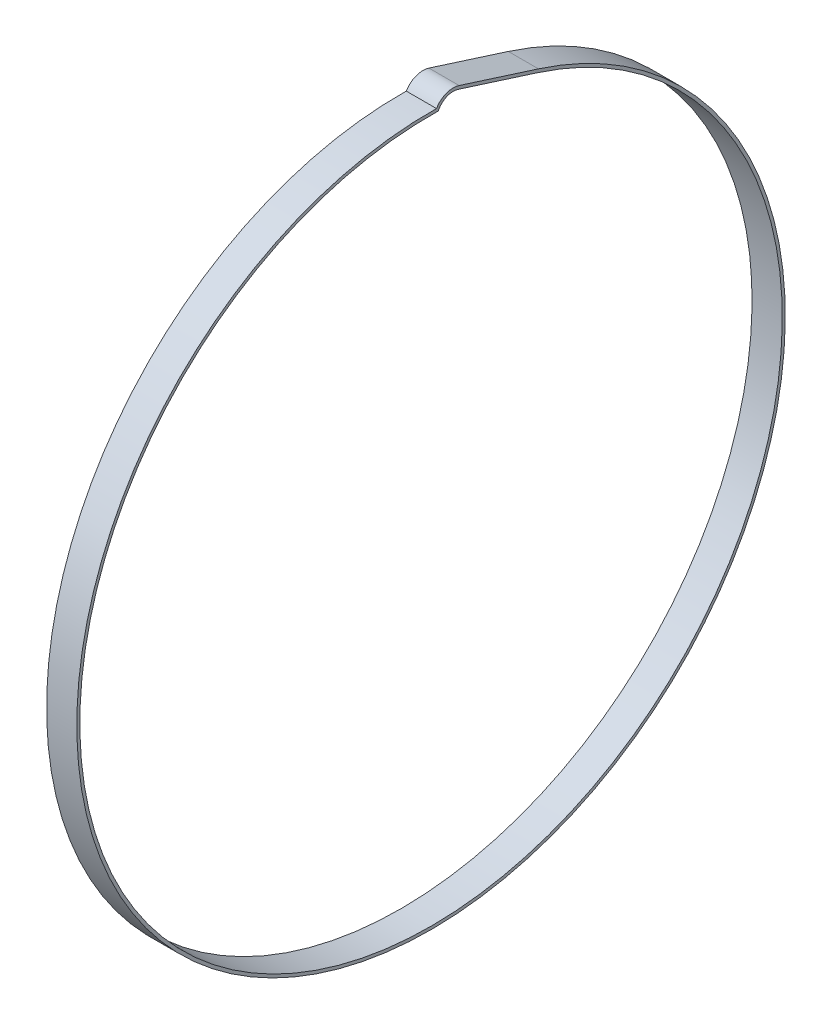
ISO-10303-21;
HEADER;
FILE_DESCRIPTION(('STEP AP214'),'2;1');
FILE_NAME('part.step','',(''),(''),'','','');
FILE_SCHEMA(('AUTOMOTIVE_DESIGN { 1 0 10303 214 1 1 1 1 }'));
ENDSEC;
DATA;
#1=APPLICATION_CONTEXT('core data for automotive mechanical design processes');
#2=APPLICATION_PROTOCOL_DEFINITION('international standard','automotive_design',2000,#1);
#3=PRODUCT_CONTEXT('',#1,'mechanical');
#4=PRODUCT('Part','Part','',(#3));
#5=PRODUCT_RELATED_PRODUCT_CATEGORY('part','',(#4));
#6=PRODUCT_DEFINITION_FORMATION('','',#4);
#7=PRODUCT_DEFINITION_CONTEXT('part definition',#1,'design');
#8=PRODUCT_DEFINITION('design','',#6,#7);
#9=PRODUCT_DEFINITION_SHAPE('','',#8);
#10=(LENGTH_UNIT() NAMED_UNIT(*) SI_UNIT(.MILLI.,.METRE.));
#11=(NAMED_UNIT(*) PLANE_ANGLE_UNIT() SI_UNIT($,.RADIAN.));
#12=(NAMED_UNIT(*) SI_UNIT($,.STERADIAN.) SOLID_ANGLE_UNIT());
#13=UNCERTAINTY_MEASURE_WITH_UNIT(LENGTH_MEASURE(1.E-05),#10,'distance_accuracy_value','');
#14=(GEOMETRIC_REPRESENTATION_CONTEXT(3) GLOBAL_UNCERTAINTY_ASSIGNED_CONTEXT((#13)) GLOBAL_UNIT_ASSIGNED_CONTEXT((#10,
#11,#12)) REPRESENTATION_CONTEXT('',''));
#15=CARTESIAN_POINT('',(0.,0.,0.));
#16=DIRECTION('',(0.,0.,1.));
#17=DIRECTION('',(1.,0.,0.));
#18=AXIS2_PLACEMENT_3D('',#15,#16,#17);
#19=CARTESIAN_POINT('',(12.7,144.783556825344,-9.316863342459));
#20=DIRECTION('',(1.,0.,0.));
#21=DIRECTION('',(0.,0.,-1.));
#22=AXIS2_PLACEMENT_3D('',#19,#20,#21);
#23=PLANE('',#22);
#24=CARTESIAN_POINT('',(12.7,144.783556825344,-9.316863342459));
#25=DIRECTION('',(1.,0.,0.));
#26=DIRECTION('',(0.,0.,-1.));
#27=AXIS2_PLACEMENT_3D('',#24,#25,#26);
#28=CIRCLE('',#27,8.17909252443305);
#29=CARTESIAN_POINT('',(12.7,152.57755531297,-11.7970129545034));
#30=VERTEX_POINT('',#29);
#31=CARTESIAN_POINT('',(12.7,148.953541859624,-2.28061581006538));
#32=VERTEX_POINT('',#31);
#33=EDGE_CURVE('E113',#30,#32,#28,.T.);
#34=ORIENTED_EDGE('',*,*,#33,.T.);
#35=CARTESIAN_POINT('',(12.7,0.,0.));
#36=DIRECTION('',(1.,0.,0.));
#37=DIRECTION('',(0.,0.,-1.));
#38=AXIS2_PLACEMENT_3D('',#35,#36,#37);
#39=CIRCLE('',#38,148.971);
#40=CARTESIAN_POINT('',(12.7,141.95703804935,-45.1725379988269));
#41=VERTEX_POINT('',#40);
#42=EDGE_CURVE('E116',#32,#41,#39,.T.);
#43=ORIENTED_EDGE('',*,*,#42,.T.);
#44=DIRECTION('',(0.,0.303230413965314,0.952917266107832));
#45=VECTOR('',#44,1.);
#46=CARTESIAN_POINT('',(12.7,141.95703804935,-45.172537998827));
#47=LINE('',#46,#45);
#48=EDGE_CURVE('E119',#41,#30,#47,.T.);
#49=ORIENTED_EDGE('',*,*,#48,.T.);
#50=EDGE_LOOP('',(#34,#43,#49));
#51=FACE_BOUND('',#50,.T.);
#52=DIRECTION('',(0.,0.303230413965313,0.952917266107832));
#53=VECTOR('',#52,1.);
#54=CARTESIAN_POINT('',(12.7,140.746833121393,-44.787435373091));
#55=LINE('',#54,#53);
#56=CARTESIAN_POINT('',(12.7,140.746833121393,-44.787435373091));
#57=VERTEX_POINT('',#56);
#58=CARTESIAN_POINT('',(12.7,151.367350385013,-11.4119103287675));
#59=VERTEX_POINT('',#58);
#60=EDGE_CURVE('E94',#57,#59,#55,.T.);
#61=ORIENTED_EDGE('',*,*,#60,.F.);
#62=CARTESIAN_POINT('',(12.7,0.,0.));
#63=DIRECTION('',(1.,0.,0.));
#64=DIRECTION('',(0.,0.,-1.));
#65=AXIS2_PLACEMENT_3D('',#62,#63,#64);
#66=CIRCLE('',#65,147.701);
#67=CARTESIAN_POINT('',(12.7,147.669722670583,-3.03947485480343));
#68=VERTEX_POINT('',#67);
#69=EDGE_CURVE('E86',#68,#57,#66,.T.);
#70=ORIENTED_EDGE('',*,*,#69,.F.);
#71=CARTESIAN_POINT('',(12.7,144.783556825344,-9.316863342459));
#72=DIRECTION('',(1.,0.,0.));
#73=DIRECTION('',(0.,0.,-1.));
#74=AXIS2_PLACEMENT_3D('',#71,#72,#73);
#75=CIRCLE('',#74,6.90909252443304);
#76=EDGE_CURVE('E103',#59,#68,#75,.T.);
#77=ORIENTED_EDGE('',*,*,#76,.F.);
#78=EDGE_LOOP('',(#61,#70,#77));
#79=FACE_BOUND('',#78,.T.);
#80=ADVANCED_FACE('F33',(#51,#79),#23,.T.);
#81=CARTESIAN_POINT('',(0.,144.783556825344,-9.316863342459));
#82=DIRECTION('',(1.,0.,0.));
#83=DIRECTION('',(0.,0.,-1.));
#84=AXIS2_PLACEMENT_3D('',#81,#82,#83);
#85=PLANE('',#84);
#86=CARTESIAN_POINT('',(0.,144.783556825344,-9.316863342459));
#87=DIRECTION('',(1.,0.,0.));
#88=DIRECTION('',(0.,0.,-1.));
#89=AXIS2_PLACEMENT_3D('',#86,#87,#88);
#90=CIRCLE('',#89,8.17909252443305);
#91=CARTESIAN_POINT('',(0.,152.57755531297,-11.7970129545034));
#92=VERTEX_POINT('',#91);
#93=CARTESIAN_POINT('',(0.,148.953541859624,-2.28061581006538));
#94=VERTEX_POINT('',#93);
#95=EDGE_CURVE('E101',#92,#94,#90,.T.);
#96=ORIENTED_EDGE('',*,*,#95,.F.);
#97=DIRECTION('',(0.,0.303230413965314,0.952917266107832));
#98=VECTOR('',#97,1.);
#99=CARTESIAN_POINT('',(0.,141.95703804935,-45.172537998827));
#100=LINE('',#99,#98);
#101=CARTESIAN_POINT('',(0.,141.95703804935,-45.1725379988269));
#102=VERTEX_POINT('',#101);
#103=EDGE_CURVE('E117',#102,#92,#100,.T.);
#104=ORIENTED_EDGE('',*,*,#103,.F.);
#105=CARTESIAN_POINT('',(0.,0.,0.));
#106=DIRECTION('',(1.,0.,0.));
#107=DIRECTION('',(0.,0.,-1.));
#108=AXIS2_PLACEMENT_3D('',#105,#106,#107);
#109=CIRCLE('',#108,148.971);
#110=EDGE_CURVE('E124',#94,#102,#109,.T.);
#111=ORIENTED_EDGE('',*,*,#110,.F.);
#112=EDGE_LOOP('',(#96,#104,#111));
#113=FACE_BOUND('',#112,.T.);
#114=CARTESIAN_POINT('',(0.,0.,0.));
#115=DIRECTION('',(1.,0.,0.));
#116=DIRECTION('',(0.,0.,-1.));
#117=AXIS2_PLACEMENT_3D('',#114,#115,#116);
#118=CIRCLE('',#117,147.701);
#119=CARTESIAN_POINT('',(0.,147.669722670583,-3.03947485480343));
#120=VERTEX_POINT('',#119);
#121=CARTESIAN_POINT('',(0.,140.746833121393,-44.787435373091));
#122=VERTEX_POINT('',#121);
#123=EDGE_CURVE('E56',#120,#122,#118,.T.);
#124=ORIENTED_EDGE('',*,*,#123,.T.);
#125=DIRECTION('',(0.,0.303230413965313,0.952917266107832));
#126=VECTOR('',#125,1.);
#127=CARTESIAN_POINT('',(0.,140.746833121393,-44.787435373091));
#128=LINE('',#127,#126);
#129=CARTESIAN_POINT('',(0.,151.367350385013,-11.4119103287675));
#130=VERTEX_POINT('',#129);
#131=EDGE_CURVE('E100',#122,#130,#128,.T.);
#132=ORIENTED_EDGE('',*,*,#131,.T.);
#133=CARTESIAN_POINT('',(0.,144.783556825344,-9.316863342459));
#134=DIRECTION('',(1.,0.,0.));
#135=DIRECTION('',(0.,0.,-1.));
#136=AXIS2_PLACEMENT_3D('',#133,#134,#135);
#137=CIRCLE('',#136,6.90909252443304);
#138=EDGE_CURVE('E95',#130,#120,#137,.T.);
#139=ORIENTED_EDGE('',*,*,#138,.T.);
#140=EDGE_LOOP('',(#124,#132,#139));
#141=FACE_BOUND('',#140,.T.);
#142=ADVANCED_FACE('F138',(#113,#141),#85,.F.);
#143=CARTESIAN_POINT('',(12.7,144.783556825344,-9.316863342459));
#144=DIRECTION('',(-1.,0.,0.));
#145=DIRECTION('',(0.,0.,1.));
#146=AXIS2_PLACEMENT_3D('',#143,#144,#145);
#147=CYLINDRICAL_SURFACE('',#146,8.17909252443305);
#148=ORIENTED_EDGE('',*,*,#95,.T.);
#149=DIRECTION('',(-1.,0.,0.));
#150=VECTOR('',#149,1.);
#151=CARTESIAN_POINT('',(12.7,148.953541859624,-2.28061581006538));
#152=LINE('',#151,#150);
#153=EDGE_CURVE('E11',#32,#94,#152,.T.);
#154=ORIENTED_EDGE('',*,*,#153,.F.);
#155=ORIENTED_EDGE('',*,*,#33,.F.);
#156=DIRECTION('',(-1.,0.,0.));
#157=VECTOR('',#156,1.);
#158=CARTESIAN_POINT('',(12.7,152.57755531297,-11.7970129545034));
#159=LINE('',#158,#157);
#160=EDGE_CURVE('E121',#30,#92,#159,.T.);
#161=ORIENTED_EDGE('',*,*,#160,.T.);
#162=EDGE_LOOP('',(#148,#154,#155,#161));
#163=FACE_BOUND('',#162,.T.);
#164=ADVANCED_FACE('F35',(#163),#147,.T.);
#165=CARTESIAN_POINT('',(12.7,0.,0.));
#166=DIRECTION('',(-1.,0.,0.));
#167=DIRECTION('',(0.,0.,1.));
#168=AXIS2_PLACEMENT_3D('',#165,#166,#167);
#169=CYLINDRICAL_SURFACE('',#168,148.971);
#170=ORIENTED_EDGE('',*,*,#110,.T.);
#171=DIRECTION('',(-1.,0.,0.));
#172=VECTOR('',#171,1.);
#173=CARTESIAN_POINT('',(12.7,141.95703804935,-45.1725379988269));
#174=LINE('',#173,#172);
#175=EDGE_CURVE('E41',#41,#102,#174,.T.);
#176=ORIENTED_EDGE('',*,*,#175,.F.);
#177=ORIENTED_EDGE('',*,*,#42,.F.);
#178=ORIENTED_EDGE('',*,*,#153,.T.);
#179=EDGE_LOOP('',(#170,#176,#177,#178));
#180=FACE_BOUND('',#179,.T.);
#181=ADVANCED_FACE('F144',(#180),#169,.T.);
#182=CARTESIAN_POINT('',(12.7,141.95703804935,-45.172537998827));
#183=DIRECTION('',(0.,-0.952917266107832,0.303230413965314));
#184=DIRECTION('',(0.,-0.303230413965314,-0.952917266107832));
#185=AXIS2_PLACEMENT_3D('',#182,#183,#184);
#186=PLANE('',#185);
#187=ORIENTED_EDGE('',*,*,#103,.T.);
#188=ORIENTED_EDGE('',*,*,#160,.F.);
#189=ORIENTED_EDGE('',*,*,#48,.F.);
#190=ORIENTED_EDGE('',*,*,#175,.T.);
#191=EDGE_LOOP('',(#187,#188,#189,#190));
#192=FACE_BOUND('',#191,.T.);
#193=ADVANCED_FACE('F133',(#192),#186,.F.);
#194=CARTESIAN_POINT('',(12.7,0.,0.));
#195=DIRECTION('',(-1.,0.,0.));
#196=DIRECTION('',(0.,0.,1.));
#197=AXIS2_PLACEMENT_3D('',#194,#195,#196);
#198=CYLINDRICAL_SURFACE('',#197,147.701);
#199=ORIENTED_EDGE('',*,*,#123,.F.);
#200=DIRECTION('',(-1.,0.,0.));
#201=VECTOR('',#200,1.);
#202=CARTESIAN_POINT('',(12.7,147.669722670583,-3.03947485480343));
#203=LINE('',#202,#201);
#204=EDGE_CURVE('E90',#68,#120,#203,.T.);
#205=ORIENTED_EDGE('',*,*,#204,.F.);
#206=ORIENTED_EDGE('',*,*,#69,.T.);
#207=DIRECTION('',(-1.,0.,0.));
#208=VECTOR('',#207,1.);
#209=CARTESIAN_POINT('',(12.7,140.746833121393,-44.787435373091));
#210=LINE('',#209,#208);
#211=EDGE_CURVE('E89',#57,#122,#210,.T.);
#212=ORIENTED_EDGE('',*,*,#211,.T.);
#213=EDGE_LOOP('',(#199,#205,#206,#212));
#214=FACE_BOUND('',#213,.T.);
#215=ADVANCED_FACE('F88',(#214),#198,.F.);
#216=CARTESIAN_POINT('',(12.7,140.746833121393,-44.787435373091));
#217=DIRECTION('',(0.,-0.952917266107832,0.303230413965313));
#218=DIRECTION('',(0.,-0.303230413965313,-0.952917266107832));
#219=AXIS2_PLACEMENT_3D('',#216,#217,#218);
#220=PLANE('',#219);
#221=ORIENTED_EDGE('',*,*,#131,.F.);
#222=ORIENTED_EDGE('',*,*,#211,.F.);
#223=ORIENTED_EDGE('',*,*,#60,.T.);
#224=DIRECTION('',(-1.,0.,0.));
#225=VECTOR('',#224,1.);
#226=CARTESIAN_POINT('',(12.7,151.367350385013,-11.4119103287675));
#227=LINE('',#226,#225);
#228=EDGE_CURVE('E48',#59,#130,#227,.T.);
#229=ORIENTED_EDGE('',*,*,#228,.T.);
#230=EDGE_LOOP('',(#221,#222,#223,#229));
#231=FACE_BOUND('',#230,.T.);
#232=ADVANCED_FACE('F98',(#231),#220,.T.);
#233=CARTESIAN_POINT('',(12.7,144.783556825344,-9.316863342459));
#234=DIRECTION('',(-1.,0.,0.));
#235=DIRECTION('',(0.,0.,1.));
#236=AXIS2_PLACEMENT_3D('',#233,#234,#235);
#237=CYLINDRICAL_SURFACE('',#236,6.90909252443304);
#238=ORIENTED_EDGE('',*,*,#138,.F.);
#239=ORIENTED_EDGE('',*,*,#228,.F.);
#240=ORIENTED_EDGE('',*,*,#76,.T.);
#241=ORIENTED_EDGE('',*,*,#204,.T.);
#242=EDGE_LOOP('',(#238,#239,#240,#241));
#243=FACE_BOUND('',#242,.T.);
#244=ADVANCED_FACE('F162',(#243),#237,.F.);
#245=CLOSED_SHELL('',(#80,#142,#164,#181,#193,#215,#232,#244));
#246=MANIFOLD_SOLID_BREP('B2',#245);
#247=ADVANCED_BREP_SHAPE_REPRESENTATION('',(#18,#246),#14);
#248=SHAPE_DEFINITION_REPRESENTATION(#9,#247);
ENDSEC;
END-ISO-10303-21;
